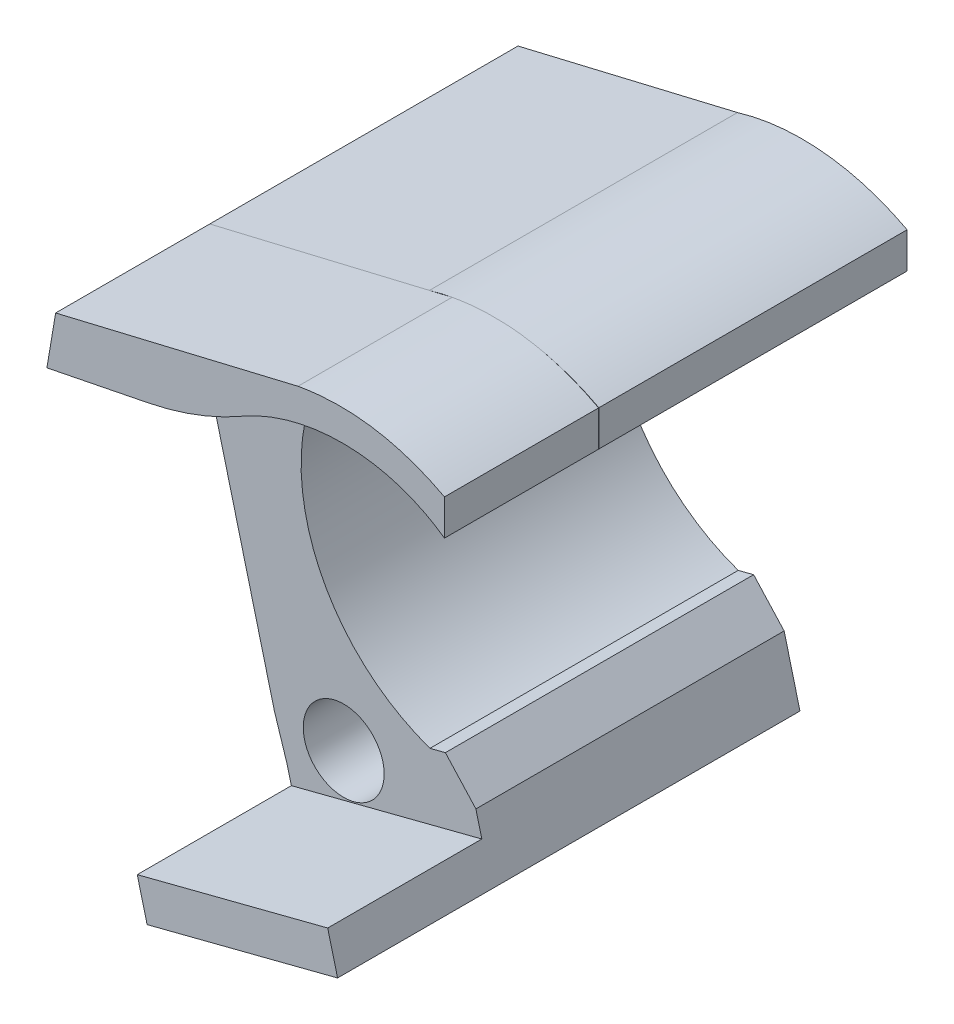
ISO-10303-21;
HEADER;
FILE_DESCRIPTION(('STEP AP214'),'2;1');
FILE_NAME('part.step','',(''),(''),'','','');
FILE_SCHEMA(('AUTOMOTIVE_DESIGN { 1 0 10303 214 1 1 1 1 }'));
ENDSEC;
DATA;
#1=APPLICATION_CONTEXT('core data for automotive mechanical design processes');
#2=APPLICATION_PROTOCOL_DEFINITION('international standard','automotive_design',2000,#1);
#3=PRODUCT_CONTEXT('',#1,'mechanical');
#4=PRODUCT('Part','Part','',(#3));
#5=PRODUCT_RELATED_PRODUCT_CATEGORY('part','',(#4));
#6=PRODUCT_DEFINITION_FORMATION('','',#4);
#7=PRODUCT_DEFINITION_CONTEXT('part definition',#1,'design');
#8=PRODUCT_DEFINITION('design','',#6,#7);
#9=PRODUCT_DEFINITION_SHAPE('','',#8);
#10=(LENGTH_UNIT() NAMED_UNIT(*) SI_UNIT(.MILLI.,.METRE.));
#11=(NAMED_UNIT(*) PLANE_ANGLE_UNIT() SI_UNIT($,.RADIAN.));
#12=(NAMED_UNIT(*) SI_UNIT($,.STERADIAN.) SOLID_ANGLE_UNIT());
#13=UNCERTAINTY_MEASURE_WITH_UNIT(LENGTH_MEASURE(1.E-05),#10,'distance_accuracy_value','');
#14=(GEOMETRIC_REPRESENTATION_CONTEXT(3) GLOBAL_UNCERTAINTY_ASSIGNED_CONTEXT((#13)) GLOBAL_UNIT_ASSIGNED_CONTEXT((#10,
#11,#12)) REPRESENTATION_CONTEXT('',''));
#15=CARTESIAN_POINT('',(0.,0.,0.));
#16=DIRECTION('',(0.,0.,1.));
#17=DIRECTION('',(1.,0.,0.));
#18=AXIS2_PLACEMENT_3D('',#15,#16,#17);
#19=CARTESIAN_POINT('',(6.21706698044238,2.36319035345385,20.));
#20=DIRECTION('',(0.,0.,1.));
#21=DIRECTION('',(1.,0.,0.));
#22=AXIS2_PLACEMENT_3D('',#19,#20,#21);
#23=PLANE('',#22);
#24=CARTESIAN_POINT('',(-8.52643317852499,7.66022940909251,20.));
#25=DIRECTION('',(0.,0.,1.));
#26=DIRECTION('',(1.,0.,0.));
#27=AXIS2_PLACEMENT_3D('',#24,#25,#26);
#28=CIRCLE('',#27,2.62500000000004);
#29=CARTESIAN_POINT('',(-5.90143317852495,7.66022940909251,20.));
#30=VERTEX_POINT('',#29);
#31=EDGE_CURVE('E301',#30,#30,#28,.T.);
#32=ORIENTED_EDGE('',*,*,#31,.F.);
#33=EDGE_LOOP('',(#32));
#34=FACE_BOUND('',#33,.T.);
#35=CARTESIAN_POINT('',(-3.52033937728079,-12.3631903534543,20.));
#36=DIRECTION('',(0.,0.,1.));
#37=DIRECTION('',(1.,0.,0.));
#38=AXIS2_PLACEMENT_3D('',#35,#36,#37);
#39=CIRCLE('',#38,2.625);
#40=CARTESIAN_POINT('',(-0.895339377280791,-12.3631903534543,20.));
#41=VERTEX_POINT('',#40);
#42=EDGE_CURVE('E288',#41,#41,#39,.T.);
#43=ORIENTED_EDGE('',*,*,#42,.F.);
#44=EDGE_LOOP('',(#43));
#45=FACE_BOUND('',#44,.T.);
#46=DIRECTION('',(0.249211228843992,-0.968449153759797,0.));
#47=VECTOR('',#46,1.);
#48=CARTESIAN_POINT('',(-6.27373327336889,-18.5142254607358,20.));
#49=LINE('',#48,#47);
#50=CARTESIAN_POINT('',(-7.18429004086763,-14.9757495460472,20.));
#51=VERTEX_POINT('',#50);
#52=CARTESIAN_POINT('',(-6.91426899658147,-16.0250668382467,20.));
#53=VERTEX_POINT('',#52);
#54=EDGE_CURVE('E498',#51,#53,#49,.T.);
#55=ORIENTED_EDGE('',*,*,#54,.T.);
#56=DIRECTION('',(-0.968449153759797,-0.249211228843992,0.));
#57=VECTOR('',#56,1.);
#58=CARTESIAN_POINT('',(-6.91426899658147,-16.0250668382467,20.));
#59=LINE('',#58,#57);
#60=CARTESIAN_POINT('',(5.44360341302429,-12.8450128755386,20.));
#61=VERTEX_POINT('',#60);
#62=EDGE_CURVE('E239',#61,#53,#59,.T.);
#63=ORIENTED_EDGE('',*,*,#62,.F.);
#64=DIRECTION('',(-0.249211228843992,0.968449153759797,0.));
#65=VECTOR('',#64,1.);
#66=CARTESIAN_POINT('',(5.05792450172748,-11.346242466994,20.));
#67=LINE('',#66,#65);
#68=CARTESIAN_POINT('',(5.05792450172748,-11.346242466994,20.));
#69=VERTEX_POINT('',#68);
#70=EDGE_CURVE('E496',#61,#69,#67,.T.);
#71=ORIENTED_EDGE('',*,*,#70,.T.);
#72=DIRECTION('',(-0.673575724194871,0.739118220432534,0.));
#73=VECTOR('',#72,1.);
#74=CARTESIAN_POINT('',(3.07887522949627,-9.17462118716204,20.));
#75=LINE('',#74,#73);
#76=CARTESIAN_POINT('',(3.07887522949627,-9.17462118716204,20.));
#77=VERTEX_POINT('',#76);
#78=EDGE_CURVE('E494',#69,#77,#75,.T.);
#79=ORIENTED_EDGE('',*,*,#78,.T.);
#80=DIRECTION('',(-0.968449153759797,-0.249211228843991,0.));
#81=VECTOR('',#80,1.);
#82=CARTESIAN_POINT('',(2.07887522949626,-9.43195140204888,20.));
#83=LINE('',#82,#81);
#84=CARTESIAN_POINT('',(2.07887522949626,-9.43195140204888,20.));
#85=VERTEX_POINT('',#84);
#86=EDGE_CURVE('E459',#77,#85,#83,.T.);
#87=ORIENTED_EDGE('',*,*,#86,.T.);
#88=CARTESIAN_POINT('',(6.21706698044238,2.36319035345385,20.));
#89=DIRECTION('',(0.,0.,-1.));
#90=DIRECTION('',(1.,0.,0.));
#91=AXIS2_PLACEMENT_3D('',#88,#89,#90);
#92=CIRCLE('',#91,12.5000000000001);
#93=CARTESIAN_POINT('',(-2.14875020251746,11.650983571506,20.));
#94=VERTEX_POINT('',#93);
#95=EDGE_CURVE('E421',#85,#94,#92,.T.);
#96=ORIENTED_EDGE('',*,*,#95,.T.);
#97=CARTESIAN_POINT('',(-2.14875020251746,11.650983571506,20.));
#98=CARTESIAN_POINT('',(-1.824492343749,11.9430531625174,20.));
#99=CARTESIAN_POINT('',(-1.48065518380505,12.2117980460191,20.));
#100=B_SPLINE_CURVE_WITH_KNOTS('',2,(#97,#98,#99),.UNSPECIFIED.,.F.,.F.,(3,3),(0.,1.),.UNSPECIFIED.);
#101=CARTESIAN_POINT('',(-1.48065518380505,12.2117980460191,20.));
#102=VERTEX_POINT('',#101);
#103=EDGE_CURVE('E365',#94,#102,#100,.T.);
#104=ORIENTED_EDGE('',*,*,#103,.T.);
#105=CARTESIAN_POINT('',(-0.365488456900622,12.9895709185526,20.));
#106=VERTEX_POINT('',#105);
#107=EDGE_CURVE('E419',#102,#106,#92,.T.);
#108=ORIENTED_EDGE('',*,*,#107,.T.);
#109=CARTESIAN_POINT('',(-10.1162684343361,30.4515951377445,20.));
#110=DIRECTION('',(0.,0.,1.));
#111=DIRECTION('',(1.,0.,0.));
#112=AXIS2_PLACEMENT_3D('',#109,#110,#111);
#113=CIRCLE('',#112,20.);
#114=CARTESIAN_POINT('',(-6.18478654664914,10.8418156854715,20.));
#115=VERTEX_POINT('',#114);
#116=EDGE_CURVE('E11',#106,#115,#113,.F.);
#117=ORIENTED_EDGE('',*,*,#116,.T.);
#118=DIRECTION('',(0.980488972613651,0.196574094384348,0.));
#119=VECTOR('',#118,1.);
#120=CARTESIAN_POINT('',(-12.7765907056596,9.52025270097164,20.));
#121=LINE('',#120,#119);
#122=CARTESIAN_POINT('',(-12.7765907056596,9.52025270097164,20.));
#123=VERTEX_POINT('',#122);
#124=EDGE_CURVE('E366',#123,#115,#121,.T.);
#125=ORIENTED_EDGE('',*,*,#124,.F.);
#126=DIRECTION('',(-0.166040492856373,-0.986118935388634,0.));
#127=VECTOR('',#126,1.);
#128=CARTESIAN_POINT('',(-12.9639683877738,8.40741162694617,20.));
#129=LINE('',#128,#127);
#130=CARTESIAN_POINT('',(-12.9639683877738,8.40741162694617,20.));
#131=VERTEX_POINT('',#130);
#132=EDGE_CURVE('E506',#123,#131,#129,.T.);
#133=ORIENTED_EDGE('',*,*,#132,.T.);
#134=CARTESIAN_POINT('',(-8.52643317852499,7.66022940909251,20.));
#135=DIRECTION('',(0.,0.,1.));
#136=DIRECTION('',(1.,0.,0.));
#137=AXIS2_PLACEMENT_3D('',#134,#135,#136);
#138=CIRCLE('',#137,4.49999999999992);
#139=CARTESIAN_POINT('',(-12.8783605692002,6.51535911674923,20.));
#140=VERTEX_POINT('',#139);
#141=EDGE_CURVE('E504',#131,#140,#138,.T.);
#142=ORIENTED_EDGE('',*,*,#141,.T.);
#143=DIRECTION('',(0.249211228843991,-0.968449153759797,0.));
#144=VECTOR('',#143,1.);
#145=CARTESIAN_POINT('',(-12.8783605692002,6.51535911674923,20.));
#146=LINE('',#145,#144);
#147=CARTESIAN_POINT('',(-8.02033937728079,-12.3631903534543,20.));
#148=VERTEX_POINT('',#147);
#149=EDGE_CURVE('E502',#140,#148,#146,.T.);
#150=ORIENTED_EDGE('',*,*,#149,.T.);
#151=DIRECTION('',(0.304785778396192,-0.952420930727285,0.));
#152=VECTOR('',#151,1.);
#153=CARTESIAN_POINT('',(-7.18429004086763,-14.9757495460472,20.));
#154=LINE('',#153,#152);
#155=EDGE_CURVE('E500',#148,#51,#154,.T.);
#156=ORIENTED_EDGE('',*,*,#155,.T.);
#157=EDGE_LOOP('',(#55,#63,#71,#79,#87,#96,#104,#108,#117,#125,#133,#142,#150,#156));
#158=FACE_BOUND('',#157,.T.);
#159=ADVANCED_FACE('F37',(#34,#45,#158),#23,.T.);
#160=CARTESIAN_POINT('',(13.0203393772824,15.1680911611288,20.));
#161=CARTESIAN_POINT('',(8.54354806774529,17.5408216803785,20.));
#162=CARTESIAN_POINT('',(3.51569604462101,16.632060198804,20.));
#163=B_SPLINE_CURVE_WITH_KNOTS('',2,(#160,#161,#162),.UNSPECIFIED.,.F.,.F.,(3,3),(0.,1.),.UNSPECIFIED.);
#164=CARTESIAN_POINT('',(13.0203393772824,15.1680911611288,20.));
#165=VERTEX_POINT('',#164);
#166=CARTESIAN_POINT('',(8.77719000469298,16.6580783102427,20.));
#167=VERTEX_POINT('',#166);
#168=EDGE_CURVE('E250',#165,#167,#163,.T.);
#169=ORIENTED_EDGE('',*,*,#168,.F.);
#170=DIRECTION('',(0.,1.,0.));
#171=VECTOR('',#170,1.);
#172=CARTESIAN_POINT('',(13.0203393772824,12.849633253427,20.));
#173=LINE('',#172,#171);
#174=CARTESIAN_POINT('',(13.0203393741779,12.8776963088814,20.));
#175=VERTEX_POINT('',#174);
#176=EDGE_CURVE('E386',#175,#165,#173,.T.);
#177=ORIENTED_EDGE('',*,*,#176,.F.);
#178=CARTESIAN_POINT('',(-0.33287714764087,13.0097030181244,20.));
#179=CARTESIAN_POINT('',(3.63531983074149,15.4300888750587,20.));
#180=CARTESIAN_POINT('',(9.06122238437333,15.6828100548504,20.));
#181=CARTESIAN_POINT('',(13.0361434432035,12.8665204564571,20.));
#182=B_SPLINE_CURVE_WITH_KNOTS('',3,(#178,#179,#180,#181),.UNSPECIFIED.,.F.,.F.,(4,4),
(0.13798914785217,1.),.UNSPECIFIED.);
#183=CARTESIAN_POINT('',(13.0361434432035,12.8665204564571,20.));
#184=VERTEX_POINT('',#183);
#185=EDGE_CURVE('E314',#175,#184,#182,.T.);
#186=ORIENTED_EDGE('',*,*,#185,.T.);
#187=DIRECTION('',(0.,1.,0.));
#188=VECTOR('',#187,1.);
#189=CARTESIAN_POINT('',(13.0361434432035,12.8665204564571,20.));
#190=LINE('',#189,#188);
#191=CARTESIAN_POINT('',(13.0361434432035,15.1849783641589,20.));
#192=VERTEX_POINT('',#191);
#193=EDGE_CURVE('E313',#184,#192,#190,.T.);
#194=ORIENTED_EDGE('',*,*,#193,.T.);
#195=CARTESIAN_POINT('',(6.21706698044238,2.36319035345385,20.));
#196=DIRECTION('',(0.,0.,1.));
#197=DIRECTION('',(1.,0.,0.));
#198=AXIS2_PLACEMENT_3D('',#195,#196,#197);
#199=CIRCLE('',#198,14.522329413577);
#200=EDGE_CURVE('E354',#192,#167,#199,.T.);
#201=ORIENTED_EDGE('',*,*,#200,.T.);
#202=EDGE_LOOP('',(#169,#177,#186,#194,#201));
#203=FACE_BOUND('',#202,.T.);
#204=ADVANCED_FACE('F544',(#203),#23,.T.);
#205=DIRECTION('',(-0.972805500576496,-0.231623526542777,0.));
#206=VECTOR('',#205,1.);
#207=CARTESIAN_POINT('',(3.51569604462101,16.632060198804,20.));
#208=LINE('',#207,#206);
#209=CARTESIAN_POINT('',(3.51569604462105,16.632060198804,20.));
#210=VERTEX_POINT('',#209);
#211=CARTESIAN_POINT('',(2.19832780114308,16.3183968014147,20.));
#212=VERTEX_POINT('',#211);
#213=EDGE_CURVE('E391',#210,#212,#208,.T.);
#214=ORIENTED_EDGE('',*,*,#213,.F.);
#215=EDGE_CURVE('E337',#210,#212,#199,.T.);
#216=ORIENTED_EDGE('',*,*,#215,.T.);
#217=EDGE_LOOP('',(#214,#216));
#218=FACE_BOUND('',#217,.T.);
#219=ADVANCED_FACE('F546',(#218),#23,.T.);
#220=CARTESIAN_POINT('',(6.21706698044238,2.36319035345385,0.));
#221=DIRECTION('',(0.,0.,1.));
#222=DIRECTION('',(1.,0.,0.));
#223=AXIS2_PLACEMENT_3D('',#220,#221,#222);
#224=PLANE('',#223);
#225=CARTESIAN_POINT('',(6.21706698044238,2.36319035345385,0.));
#226=DIRECTION('',(0.,0.,-1.));
#227=DIRECTION('',(1.,0.,0.));
#228=AXIS2_PLACEMENT_3D('',#225,#226,#227);
#229=CIRCLE('',#228,12.5000000000001);
#230=CARTESIAN_POINT('',(2.07887522949626,-9.43195140204888,0.));
#231=VERTEX_POINT('',#230);
#232=CARTESIAN_POINT('',(-0.33287714764087,13.0097030181244,0.));
#233=VERTEX_POINT('',#232);
#234=EDGE_CURVE('E304',#231,#233,#229,.T.);
#235=ORIENTED_EDGE('',*,*,#234,.F.);
#236=DIRECTION('',(-0.968449153759797,-0.249211228843991,0.));
#237=VECTOR('',#236,1.);
#238=CARTESIAN_POINT('',(2.07887522949626,-9.43195140204888,0.));
#239=LINE('',#238,#237);
#240=CARTESIAN_POINT('',(3.07887522949627,-9.17462118716204,0.));
#241=VERTEX_POINT('',#240);
#242=EDGE_CURVE('E460',#241,#231,#239,.T.);
#243=ORIENTED_EDGE('',*,*,#242,.F.);
#244=DIRECTION('',(-0.673575724194871,0.739118220432534,0.));
#245=VECTOR('',#244,1.);
#246=CARTESIAN_POINT('',(3.07887522949627,-9.17462118716204,0.));
#247=LINE('',#246,#245);
#248=CARTESIAN_POINT('',(5.05792450172748,-11.346242466994,0.));
#249=VERTEX_POINT('',#248);
#250=EDGE_CURVE('E463',#249,#241,#247,.T.);
#251=ORIENTED_EDGE('',*,*,#250,.F.);
#252=DIRECTION('',(-0.249211228843992,0.968449153759797,0.));
#253=VECTOR('',#252,1.);
#254=CARTESIAN_POINT('',(5.05792450172748,-11.346242466994,0.));
#255=LINE('',#254,#253);
#256=CARTESIAN_POINT('',(6.08413913623686,-15.3341714980277,0.));
#257=VERTEX_POINT('',#256);
#258=EDGE_CURVE('E465',#257,#249,#255,.T.);
#259=ORIENTED_EDGE('',*,*,#258,.F.);
#260=DIRECTION('',(0.968449153759797,0.249211228843991,0.));
#261=VECTOR('',#260,1.);
#262=CARTESIAN_POINT('',(6.08413913623686,-15.3341714980277,0.));
#263=LINE('',#262,#261);
#264=CARTESIAN_POINT('',(-6.27373327336889,-18.5142254607358,0.));
#265=VERTEX_POINT('',#264);
#266=EDGE_CURVE('E220',#265,#257,#263,.T.);
#267=ORIENTED_EDGE('',*,*,#266,.F.);
#268=DIRECTION('',(0.249211228843992,-0.968449153759797,0.));
#269=VECTOR('',#268,1.);
#270=CARTESIAN_POINT('',(-6.27373327336889,-18.5142254607358,0.));
#271=LINE('',#270,#269);
#272=CARTESIAN_POINT('',(-7.18429004086763,-14.9757495460472,0.));
#273=VERTEX_POINT('',#272);
#274=EDGE_CURVE('E468',#273,#265,#271,.T.);
#275=ORIENTED_EDGE('',*,*,#274,.F.);
#276=DIRECTION('',(0.304785778396192,-0.952420930727285,0.));
#277=VECTOR('',#276,1.);
#278=CARTESIAN_POINT('',(-7.18429004086763,-14.9757495460472,0.));
#279=LINE('',#278,#277);
#280=CARTESIAN_POINT('',(-8.02033937728079,-12.3631903534543,0.));
#281=VERTEX_POINT('',#280);
#282=EDGE_CURVE('E470',#281,#273,#279,.T.);
#283=ORIENTED_EDGE('',*,*,#282,.F.);
#284=DIRECTION('',(0.249211228843991,-0.968449153759797,0.));
#285=VECTOR('',#284,1.);
#286=CARTESIAN_POINT('',(-12.8783605692002,6.51535911674923,0.));
#287=LINE('',#286,#285);
#288=CARTESIAN_POINT('',(-12.8783605692002,6.51535911674923,0.));
#289=VERTEX_POINT('',#288);
#290=EDGE_CURVE('E472',#289,#281,#287,.T.);
#291=ORIENTED_EDGE('',*,*,#290,.F.);
#292=CARTESIAN_POINT('',(-8.52643317852499,7.66022940909251,0.));
#293=DIRECTION('',(0.,0.,1.));
#294=DIRECTION('',(1.,0.,0.));
#295=AXIS2_PLACEMENT_3D('',#292,#293,#294);
#296=CIRCLE('',#295,4.49999999999992);
#297=CARTESIAN_POINT('',(-12.9639683877738,8.40741162694617,0.));
#298=VERTEX_POINT('',#297);
#299=EDGE_CURVE('E474',#298,#289,#296,.T.);
#300=ORIENTED_EDGE('',*,*,#299,.F.);
#301=DIRECTION('',(-0.166040492856373,-0.986118935388634,0.));
#302=VECTOR('',#301,1.);
#303=CARTESIAN_POINT('',(-12.9639683877738,8.40741162694617,0.));
#304=LINE('',#303,#302);
#305=CARTESIAN_POINT('',(-12.2095534864732,12.8879019369534,0.));
#306=VERTEX_POINT('',#305);
#307=EDGE_CURVE('E476',#306,#298,#304,.T.);
#308=ORIENTED_EDGE('',*,*,#307,.F.);
#309=DIRECTION('',(-0.972950913660848,-0.231011946891326,0.));
#310=VECTOR('',#309,1.);
#311=CARTESIAN_POINT('',(-12.2095534864732,12.8879019369534,0.));
#312=LINE('',#311,#310);
#313=CARTESIAN_POINT('',(2.03064838580171,16.2690147068279,0.));
#314=VERTEX_POINT('',#313);
#315=EDGE_CURVE('E478',#314,#306,#312,.T.);
#316=ORIENTED_EDGE('',*,*,#315,.F.);
#317=CARTESIAN_POINT('',(6.21706698044238,2.36319035345385,0.));
#318=DIRECTION('',(0.,0.,1.));
#319=DIRECTION('',(1.,0.,0.));
#320=AXIS2_PLACEMENT_3D('',#317,#318,#319);
#321=CIRCLE('',#320,14.522329413577);
#322=CARTESIAN_POINT('',(13.0361434432035,15.1849783641589,0.));
#323=VERTEX_POINT('',#322);
#324=EDGE_CURVE('E480',#323,#314,#321,.T.);
#325=ORIENTED_EDGE('',*,*,#324,.F.);
#326=DIRECTION('',(0.,1.,0.));
#327=VECTOR('',#326,1.);
#328=CARTESIAN_POINT('',(13.0361434432035,12.8665204564571,0.));
#329=LINE('',#328,#327);
#330=CARTESIAN_POINT('',(13.0361434432035,12.8665204564571,0.));
#331=VERTEX_POINT('',#330);
#332=EDGE_CURVE('E482',#331,#323,#329,.T.);
#333=ORIENTED_EDGE('',*,*,#332,.F.);
#334=CARTESIAN_POINT('',(-0.33287714764087,13.0097030181244,0.));
#335=CARTESIAN_POINT('',(3.63531983074149,15.4300888750587,0.));
#336=CARTESIAN_POINT('',(9.06122238437333,15.6828100548504,0.));
#337=CARTESIAN_POINT('',(13.0361434432035,12.8665204564571,0.));
#338=B_SPLINE_CURVE_WITH_KNOTS('',3,(#334,#335,#336,#337),.UNSPECIFIED.,.F.,.F.,(4,4),
(0.13798914785217,1.),.UNSPECIFIED.);
#339=EDGE_CURVE('E484',#233,#331,#338,.T.);
#340=ORIENTED_EDGE('',*,*,#339,.F.);
#341=EDGE_LOOP('',(#235,#243,#251,#259,#267,#275,#283,#291,#300,#308,#316,#325,#333,#340));
#342=FACE_BOUND('',#341,.T.);
#343=CARTESIAN_POINT('',(-8.52643317852499,7.66022940909251,0.));
#344=DIRECTION('',(0.,0.,1.));
#345=DIRECTION('',(1.,0.,0.));
#346=AXIS2_PLACEMENT_3D('',#343,#344,#345);
#347=CIRCLE('',#346,2.62500000000004);
#348=CARTESIAN_POINT('',(-5.90143317852495,7.66022940909251,0.));
#349=VERTEX_POINT('',#348);
#350=EDGE_CURVE('E296',#349,#349,#347,.T.);
#351=ORIENTED_EDGE('',*,*,#350,.T.);
#352=EDGE_LOOP('',(#351));
#353=FACE_BOUND('',#352,.T.);
#354=CARTESIAN_POINT('',(-3.52033937728079,-12.3631903534543,0.));
#355=DIRECTION('',(0.,0.,1.));
#356=DIRECTION('',(1.,0.,0.));
#357=AXIS2_PLACEMENT_3D('',#354,#355,#356);
#358=CIRCLE('',#357,2.625);
#359=CARTESIAN_POINT('',(-0.895339377280791,-12.3631903534543,0.));
#360=VERTEX_POINT('',#359);
#361=EDGE_CURVE('E297',#360,#360,#358,.T.);
#362=ORIENTED_EDGE('',*,*,#361,.T.);
#363=EDGE_LOOP('',(#362));
#364=FACE_BOUND('',#363,.T.);
#365=ADVANCED_FACE('F329',(#342,#353,#364),#224,.F.);
#366=CARTESIAN_POINT('',(6.21706698044238,2.36319035345385,20.));
#367=DIRECTION('',(0.,0.,-1.));
#368=DIRECTION('',(-1.,0.,0.));
#369=AXIS2_PLACEMENT_3D('',#366,#367,#368);
#370=CYLINDRICAL_SURFACE('',#369,12.5000000000001);
#371=ORIENTED_EDGE('',*,*,#234,.T.);
#372=DIRECTION('',(0.,0.,-1.));
#373=VECTOR('',#372,1.);
#374=CARTESIAN_POINT('',(-0.33287714764087,13.0097030181244,20.));
#375=LINE('',#374,#373);
#376=CARTESIAN_POINT('',(-0.33287714764087,13.0097030181244,20.));
#377=VERTEX_POINT('',#376);
#378=EDGE_CURVE('E387',#377,#233,#375,.T.);
#379=ORIENTED_EDGE('',*,*,#378,.F.);
#380=EDGE_CURVE('E462',#106,#377,#92,.T.);
#381=ORIENTED_EDGE('',*,*,#380,.F.);
#382=ORIENTED_EDGE('',*,*,#107,.F.);
#383=ORIENTED_EDGE('',*,*,#103,.F.);
#384=ORIENTED_EDGE('',*,*,#95,.F.);
#385=DIRECTION('',(0.,0.,-1.));
#386=VECTOR('',#385,1.);
#387=CARTESIAN_POINT('',(2.07887522949626,-9.43195140204888,20.));
#388=LINE('',#387,#386);
#389=EDGE_CURVE('E456',#85,#231,#388,.T.);
#390=ORIENTED_EDGE('',*,*,#389,.T.);
#391=EDGE_LOOP('',(#371,#379,#381,#382,#383,#384,#390));
#392=FACE_BOUND('',#391,.T.);
#393=ADVANCED_FACE('F324',(#392),#370,.F.);
#394=DIRECTION('',(0.,0.,-1.));
#395=VECTOR('',#394,1.);
#396=SURFACE_OF_LINEAR_EXTRUSION('',#182,#395);
#397=ORIENTED_EDGE('',*,*,#339,.T.);
#398=DIRECTION('',(0.,0.,-1.));
#399=VECTOR('',#398,1.);
#400=CARTESIAN_POINT('',(13.0361434432035,12.8665204564571,20.));
#401=LINE('',#400,#399);
#402=EDGE_CURVE('E426',#184,#331,#401,.T.);
#403=ORIENTED_EDGE('',*,*,#402,.F.);
#404=ORIENTED_EDGE('',*,*,#185,.F.);
#405=EDGE_CURVE('E307',#377,#175,#182,.T.);
#406=ORIENTED_EDGE('',*,*,#405,.F.);
#407=ORIENTED_EDGE('',*,*,#378,.T.);
#408=EDGE_LOOP('',(#397,#403,#404,#406,#407));
#409=FACE_BOUND('',#408,.T.);
#410=ADVANCED_FACE('F320',(#409),#396,.F.);
#411=CARTESIAN_POINT('',(13.0361434432035,12.8665204564571,20.));
#412=DIRECTION('',(-1.,0.,0.));
#413=DIRECTION('',(0.,0.,1.));
#414=AXIS2_PLACEMENT_3D('',#411,#412,#413);
#415=PLANE('',#414);
#416=ORIENTED_EDGE('',*,*,#332,.T.);
#417=DIRECTION('',(0.,0.,-1.));
#418=VECTOR('',#417,1.);
#419=CARTESIAN_POINT('',(13.0361434432035,15.1849783641589,20.));
#420=LINE('',#419,#418);
#421=EDGE_CURVE('E429',#192,#323,#420,.T.);
#422=ORIENTED_EDGE('',*,*,#421,.F.);
#423=ORIENTED_EDGE('',*,*,#193,.F.);
#424=ORIENTED_EDGE('',*,*,#402,.T.);
#425=EDGE_LOOP('',(#416,#422,#423,#424));
#426=FACE_BOUND('',#425,.T.);
#427=ADVANCED_FACE('F323',(#426),#415,.F.);
#428=CARTESIAN_POINT('',(6.21706698044238,2.36319035345385,20.));
#429=DIRECTION('',(0.,0.,-1.));
#430=DIRECTION('',(-1.,0.,0.));
#431=AXIS2_PLACEMENT_3D('',#428,#429,#430);
#432=CYLINDRICAL_SURFACE('',#431,14.522329413577);
#433=ORIENTED_EDGE('',*,*,#324,.T.);
#434=DIRECTION('',(0.,0.,-1.));
#435=VECTOR('',#434,1.);
#436=CARTESIAN_POINT('',(2.03064838580171,16.2690147068279,20.));
#437=LINE('',#436,#435);
#438=CARTESIAN_POINT('',(2.03064838580171,16.2690147068279,20.));
#439=VERTEX_POINT('',#438);
#440=EDGE_CURVE('E432',#439,#314,#437,.T.);
#441=ORIENTED_EDGE('',*,*,#440,.F.);
#442=EDGE_CURVE('E345',#212,#439,#199,.T.);
#443=ORIENTED_EDGE('',*,*,#442,.F.);
#444=ORIENTED_EDGE('',*,*,#215,.F.);
#445=CARTESIAN_POINT('',(6.92122174652692,16.8684382886614,20.));
#446=CARTESIAN_POINT('',(5.2512911978348,16.945761162077,20.));
#447=CARTESIAN_POINT('',(3.51569604462101,16.632060198804,20.));
#448=B_SPLINE_CURVE_WITH_KNOTS('',2,(#445,#446,#447),.UNSPECIFIED.,.F.,.F.,(3,3),
(0.654803851578889,1.),.UNSPECIFIED.);
#449=CARTESIAN_POINT('',(6.92122174652701,16.8684382886614,20.));
#450=VERTEX_POINT('',#449);
#451=EDGE_CURVE('E380',#450,#210,#448,.T.);
#452=ORIENTED_EDGE('',*,*,#451,.F.);
#453=CARTESIAN_POINT('',(8.77719000470674,16.6580783102402,20.));
#454=CARTESIAN_POINT('',(7.8595724406739,16.8249897919561,20.));
#455=CARTESIAN_POINT('',(6.92122174652692,16.8684382886614,20.));
#456=B_SPLINE_CURVE_WITH_KNOTS('',2,(#453,#454,#455),.UNSPECIFIED.,.F.,.F.,(3,3),
(0.460834679782192,0.654803851578889),.UNSPECIFIED.);
#457=EDGE_CURVE('E344',#167,#450,#456,.T.);
#458=ORIENTED_EDGE('',*,*,#457,.F.);
#459=ORIENTED_EDGE('',*,*,#200,.F.);
#460=ORIENTED_EDGE('',*,*,#421,.T.);
#461=EDGE_LOOP('',(#433,#441,#443,#444,#452,#458,#459,#460));
#462=FACE_BOUND('',#461,.T.);
#463=ADVANCED_FACE('F561',(#462),#432,.T.);
#464=CARTESIAN_POINT('',(-12.2095534864732,12.8879019369534,20.));
#465=DIRECTION('',(0.231011946891326,-0.972950913660848,0.));
#466=DIRECTION('',(0.972950913660848,0.231011946891326,0.));
#467=AXIS2_PLACEMENT_3D('',#464,#465,#466);
#468=PLANE('',#467);
#469=ORIENTED_EDGE('',*,*,#315,.T.);
#470=DIRECTION('',(0.,0.,-1.));
#471=VECTOR('',#470,1.);
#472=CARTESIAN_POINT('',(-12.2095534864732,12.8879019369534,20.));
#473=LINE('',#472,#471);
#474=CARTESIAN_POINT('',(-12.2095534864732,12.8879019369534,20.));
#475=VERTEX_POINT('',#474);
#476=EDGE_CURVE('E435',#475,#306,#473,.T.);
#477=ORIENTED_EDGE('',*,*,#476,.F.);
#478=DIRECTION('',(-0.972950913660848,-0.231011946891326,0.));
#479=VECTOR('',#478,1.);
#480=CARTESIAN_POINT('',(-12.2095534864732,12.8879019369534,20.));
#481=LINE('',#480,#479);
#482=EDGE_CURVE('E358',#439,#475,#481,.T.);
#483=ORIENTED_EDGE('',*,*,#482,.F.);
#484=ORIENTED_EDGE('',*,*,#440,.T.);
#485=EDGE_LOOP('',(#469,#477,#483,#484));
#486=FACE_BOUND('',#485,.T.);
#487=ADVANCED_FACE('F564',(#486),#468,.F.);
#488=CARTESIAN_POINT('',(-12.9639683877738,8.40741162694617,20.));
#489=DIRECTION('',(0.986118935388634,-0.166040492856373,0.));
#490=DIRECTION('',(0.166040492856373,0.986118935388634,0.));
#491=AXIS2_PLACEMENT_3D('',#488,#489,#490);
#492=PLANE('',#491);
#493=ORIENTED_EDGE('',*,*,#307,.T.);
#494=DIRECTION('',(0.,0.,-1.));
#495=VECTOR('',#494,1.);
#496=CARTESIAN_POINT('',(-12.9639683877738,8.40741162694617,20.));
#497=LINE('',#496,#495);
#498=EDGE_CURVE('E438',#131,#298,#497,.T.);
#499=ORIENTED_EDGE('',*,*,#498,.F.);
#500=ORIENTED_EDGE('',*,*,#132,.F.);
#501=DIRECTION('',(0.,0.,-1.));
#502=VECTOR('',#501,1.);
#503=CARTESIAN_POINT('',(-12.7765907056596,9.52025270097164,30.));
#504=LINE('',#503,#502);
#505=CARTESIAN_POINT('',(-12.7765907056596,9.52025270097164,30.));
#506=VERTEX_POINT('',#505);
#507=EDGE_CURVE('E396',#506,#123,#504,.T.);
#508=ORIENTED_EDGE('',*,*,#507,.F.);
#509=DIRECTION('',(-0.166040492856373,-0.986118935388634,0.));
#510=VECTOR('',#509,1.);
#511=CARTESIAN_POINT('',(-12.2095534864732,12.8879019369534,30.));
#512=LINE('',#511,#510);
#513=CARTESIAN_POINT('',(-12.2095534864732,12.8879019369534,30.));
#514=VERTEX_POINT('',#513);
#515=EDGE_CURVE('E519',#514,#506,#512,.T.);
#516=ORIENTED_EDGE('',*,*,#515,.F.);
#517=DIRECTION('',(0.,0.,-1.));
#518=VECTOR('',#517,1.);
#519=CARTESIAN_POINT('',(-12.2095534864732,12.8879019369534,30.));
#520=LINE('',#519,#518);
#521=EDGE_CURVE('E393',#514,#475,#520,.T.);
#522=ORIENTED_EDGE('',*,*,#521,.T.);
#523=ORIENTED_EDGE('',*,*,#476,.T.);
#524=EDGE_LOOP('',(#493,#499,#500,#508,#516,#522,#523));
#525=FACE_BOUND('',#524,.T.);
#526=ADVANCED_FACE('F516',(#525),#492,.F.);
#527=CARTESIAN_POINT('',(-8.52643317852499,7.66022940909251,20.));
#528=DIRECTION('',(0.,0.,-1.));
#529=DIRECTION('',(-1.,0.,0.));
#530=AXIS2_PLACEMENT_3D('',#527,#528,#529);
#531=CYLINDRICAL_SURFACE('',#530,4.49999999999992);
#532=ORIENTED_EDGE('',*,*,#299,.T.);
#533=DIRECTION('',(0.,0.,-1.));
#534=VECTOR('',#533,1.);
#535=CARTESIAN_POINT('',(-12.8783605692002,6.51535911674923,20.));
#536=LINE('',#535,#534);
#537=EDGE_CURVE('E441',#140,#289,#536,.T.);
#538=ORIENTED_EDGE('',*,*,#537,.F.);
#539=ORIENTED_EDGE('',*,*,#141,.F.);
#540=ORIENTED_EDGE('',*,*,#498,.T.);
#541=EDGE_LOOP('',(#532,#538,#539,#540));
#542=FACE_BOUND('',#541,.T.);
#543=ADVANCED_FACE('F573',(#542),#531,.T.);
#544=CARTESIAN_POINT('',(-12.8783605692002,6.51535911674923,20.));
#545=DIRECTION('',(0.968449153759797,0.249211228843991,0.));
#546=DIRECTION('',(-0.249211228843991,0.968449153759797,0.));
#547=AXIS2_PLACEMENT_3D('',#544,#545,#546);
#548=PLANE('',#547);
#549=ORIENTED_EDGE('',*,*,#290,.T.);
#550=DIRECTION('',(0.,0.,-1.));
#551=VECTOR('',#550,1.);
#552=CARTESIAN_POINT('',(-8.02033937728079,-12.3631903534543,20.));
#553=LINE('',#552,#551);
#554=EDGE_CURVE('E444',#148,#281,#553,.T.);
#555=ORIENTED_EDGE('',*,*,#554,.F.);
#556=ORIENTED_EDGE('',*,*,#149,.F.);
#557=ORIENTED_EDGE('',*,*,#537,.T.);
#558=EDGE_LOOP('',(#549,#555,#556,#557));
#559=FACE_BOUND('',#558,.T.);
#560=ADVANCED_FACE('F633',(#559),#548,.F.);
#561=CARTESIAN_POINT('',(-7.18429004086763,-14.9757495460472,20.));
#562=DIRECTION('',(0.952420930727285,0.304785778396192,0.));
#563=DIRECTION('',(-0.304785778396192,0.952420930727285,0.));
#564=AXIS2_PLACEMENT_3D('',#561,#562,#563);
#565=PLANE('',#564);
#566=ORIENTED_EDGE('',*,*,#282,.T.);
#567=DIRECTION('',(0.,0.,-1.));
#568=VECTOR('',#567,1.);
#569=CARTESIAN_POINT('',(-7.18429004086763,-14.9757495460472,20.));
#570=LINE('',#569,#568);
#571=EDGE_CURVE('E447',#51,#273,#570,.T.);
#572=ORIENTED_EDGE('',*,*,#571,.F.);
#573=ORIENTED_EDGE('',*,*,#155,.F.);
#574=ORIENTED_EDGE('',*,*,#554,.T.);
#575=EDGE_LOOP('',(#566,#572,#573,#574));
#576=FACE_BOUND('',#575,.T.);
#577=ADVANCED_FACE('F636',(#576),#565,.F.);
#578=CARTESIAN_POINT('',(-6.27373327336889,-18.5142254607358,20.));
#579=DIRECTION('',(0.968449153759797,0.249211228843992,0.));
#580=DIRECTION('',(-0.249211228843992,0.968449153759797,0.));
#581=AXIS2_PLACEMENT_3D('',#578,#579,#580);
#582=PLANE('',#581);
#583=ORIENTED_EDGE('',*,*,#274,.T.);
#584=DIRECTION('',(0.,0.,-1.));
#585=VECTOR('',#584,1.);
#586=CARTESIAN_POINT('',(-6.27373327336889,-18.5142254607358,20.));
#587=LINE('',#586,#585);
#588=CARTESIAN_POINT('',(-6.27373327336889,-18.5142254607358,30.));
#589=VERTEX_POINT('',#588);
#590=EDGE_CURVE('E223',#589,#265,#587,.T.);
#591=ORIENTED_EDGE('',*,*,#590,.F.);
#592=DIRECTION('',(0.249211228843992,-0.968449153759797,0.));
#593=VECTOR('',#592,1.);
#594=CARTESIAN_POINT('',(-6.27373327336889,-18.5142254607358,30.));
#595=LINE('',#594,#593);
#596=CARTESIAN_POINT('',(-6.91426899658147,-16.0250668382467,30.));
#597=VERTEX_POINT('',#596);
#598=EDGE_CURVE('E238',#597,#589,#595,.T.);
#599=ORIENTED_EDGE('',*,*,#598,.F.);
#600=DIRECTION('',(0.,0.,-1.));
#601=VECTOR('',#600,1.);
#602=CARTESIAN_POINT('',(-6.91426899658147,-16.0250668382467,30.));
#603=LINE('',#602,#601);
#604=EDGE_CURVE('E245',#597,#53,#603,.T.);
#605=ORIENTED_EDGE('',*,*,#604,.T.);
#606=ORIENTED_EDGE('',*,*,#54,.F.);
#607=ORIENTED_EDGE('',*,*,#571,.T.);
#608=EDGE_LOOP('',(#583,#591,#599,#605,#606,#607));
#609=FACE_BOUND('',#608,.T.);
#610=ADVANCED_FACE('F640',(#609),#582,.F.);
#611=CARTESIAN_POINT('',(6.08413913623686,-15.3341714980277,20.));
#612=DIRECTION('',(-0.249211228843991,0.968449153759797,0.));
#613=DIRECTION('',(-0.968449153759797,-0.249211228843991,0.));
#614=AXIS2_PLACEMENT_3D('',#611,#612,#613);
#615=PLANE('',#614);
#616=ORIENTED_EDGE('',*,*,#266,.T.);
#617=DIRECTION('',(0.,0.,-1.));
#618=VECTOR('',#617,1.);
#619=CARTESIAN_POINT('',(6.08413913623686,-15.3341714980277,20.));
#620=LINE('',#619,#618);
#621=CARTESIAN_POINT('',(6.08413913623686,-15.3341714980277,30.));
#622=VERTEX_POINT('',#621);
#623=EDGE_CURVE('E213',#622,#257,#620,.T.);
#624=ORIENTED_EDGE('',*,*,#623,.F.);
#625=DIRECTION('',(0.968449153759797,0.249211228843991,0.));
#626=VECTOR('',#625,1.);
#627=CARTESIAN_POINT('',(6.08413913623686,-15.3341714980277,30.));
#628=LINE('',#627,#626);
#629=EDGE_CURVE('E218',#589,#622,#628,.T.);
#630=ORIENTED_EDGE('',*,*,#629,.F.);
#631=ORIENTED_EDGE('',*,*,#590,.T.);
#632=EDGE_LOOP('',(#616,#624,#630,#631));
#633=FACE_BOUND('',#632,.T.);
#634=ADVANCED_FACE('F215',(#633),#615,.F.);
#635=CARTESIAN_POINT('',(5.05792450172748,-11.346242466994,20.));
#636=DIRECTION('',(-0.968449153759797,-0.249211228843992,0.));
#637=DIRECTION('',(0.249211228843992,-0.968449153759797,0.));
#638=AXIS2_PLACEMENT_3D('',#635,#636,#637);
#639=PLANE('',#638);
#640=ORIENTED_EDGE('',*,*,#258,.T.);
#641=DIRECTION('',(0.,0.,-1.));
#642=VECTOR('',#641,1.);
#643=CARTESIAN_POINT('',(5.05792450172748,-11.346242466994,20.));
#644=LINE('',#643,#642);
#645=EDGE_CURVE('E224',#69,#249,#644,.T.);
#646=ORIENTED_EDGE('',*,*,#645,.F.);
#647=ORIENTED_EDGE('',*,*,#70,.F.);
#648=DIRECTION('',(0.,0.,-1.));
#649=VECTOR('',#648,1.);
#650=CARTESIAN_POINT('',(5.44360341302429,-12.8450128755386,30.));
#651=LINE('',#650,#649);
#652=CARTESIAN_POINT('',(5.44360341302429,-12.8450128755386,30.));
#653=VERTEX_POINT('',#652);
#654=EDGE_CURVE('E230',#653,#61,#651,.T.);
#655=ORIENTED_EDGE('',*,*,#654,.F.);
#656=DIRECTION('',(-0.249211228843992,0.968449153759797,0.));
#657=VECTOR('',#656,1.);
#658=CARTESIAN_POINT('',(5.44360341302429,-12.8450128755386,30.));
#659=LINE('',#658,#657);
#660=EDGE_CURVE('E227',#622,#653,#659,.T.);
#661=ORIENTED_EDGE('',*,*,#660,.F.);
#662=ORIENTED_EDGE('',*,*,#623,.T.);
#663=EDGE_LOOP('',(#640,#646,#647,#655,#661,#662));
#664=FACE_BOUND('',#663,.T.);
#665=ADVANCED_FACE('F228',(#664),#639,.F.);
#666=CARTESIAN_POINT('',(3.07887522949627,-9.17462118716204,20.));
#667=DIRECTION('',(-0.739118220432534,-0.673575724194871,0.));
#668=DIRECTION('',(0.673575724194871,-0.739118220432534,0.));
#669=AXIS2_PLACEMENT_3D('',#666,#667,#668);
#670=PLANE('',#669);
#671=ORIENTED_EDGE('',*,*,#250,.T.);
#672=DIRECTION('',(0.,0.,-1.));
#673=VECTOR('',#672,1.);
#674=CARTESIAN_POINT('',(3.07887522949627,-9.17462118716204,20.));
#675=LINE('',#674,#673);
#676=EDGE_CURVE('E453',#77,#241,#675,.T.);
#677=ORIENTED_EDGE('',*,*,#676,.F.);
#678=ORIENTED_EDGE('',*,*,#78,.F.);
#679=ORIENTED_EDGE('',*,*,#645,.T.);
#680=EDGE_LOOP('',(#671,#677,#678,#679));
#681=FACE_BOUND('',#680,.T.);
#682=ADVANCED_FACE('F649',(#681),#670,.F.);
#683=CARTESIAN_POINT('',(2.07887522949626,-9.43195140204888,20.));
#684=DIRECTION('',(0.249211228843991,-0.968449153759797,0.));
#685=DIRECTION('',(0.968449153759797,0.249211228843991,0.));
#686=AXIS2_PLACEMENT_3D('',#683,#684,#685);
#687=PLANE('',#686);
#688=ORIENTED_EDGE('',*,*,#242,.T.);
#689=ORIENTED_EDGE('',*,*,#389,.F.);
#690=ORIENTED_EDGE('',*,*,#86,.F.);
#691=ORIENTED_EDGE('',*,*,#676,.T.);
#692=EDGE_LOOP('',(#688,#689,#690,#691));
#693=FACE_BOUND('',#692,.T.);
#694=ADVANCED_FACE('F652',(#693),#687,.F.);
#695=CARTESIAN_POINT('',(-8.52643317852499,7.66022940909251,20.));
#696=DIRECTION('',(0.,0.,-1.));
#697=DIRECTION('',(-1.,0.,0.));
#698=AXIS2_PLACEMENT_3D('',#695,#696,#697);
#699=CYLINDRICAL_SURFACE('',#698,2.62500000000004);
#700=ORIENTED_EDGE('',*,*,#31,.T.);
#701=EDGE_LOOP('',(#700));
#702=FACE_BOUND('',#701,.T.);
#703=ORIENTED_EDGE('',*,*,#350,.F.);
#704=EDGE_LOOP('',(#703));
#705=FACE_BOUND('',#704,.T.);
#706=ADVANCED_FACE('F655',(#702,#705),#699,.F.);
#707=CARTESIAN_POINT('',(-3.52033937728079,-12.3631903534543,20.));
#708=DIRECTION('',(0.,0.,-1.));
#709=DIRECTION('',(-1.,0.,0.));
#710=AXIS2_PLACEMENT_3D('',#707,#708,#709);
#711=CYLINDRICAL_SURFACE('',#710,2.625);
#712=ORIENTED_EDGE('',*,*,#42,.T.);
#713=EDGE_LOOP('',(#712));
#714=FACE_BOUND('',#713,.T.);
#715=ORIENTED_EDGE('',*,*,#361,.F.);
#716=EDGE_LOOP('',(#715));
#717=FACE_BOUND('',#716,.T.);
#718=ADVANCED_FACE('F273',(#714,#717),#711,.F.);
#719=CARTESIAN_POINT('',(8.4057828893485,16.7204486801725,20.));
#720=DIRECTION('',(0.,0.,-1.));
#721=DIRECTION('',(-1.,0.,0.));
#722=AXIS2_PLACEMENT_3D('',#719,#720,#721);
#723=PLANE('',#722);
#724=CARTESIAN_POINT('',(-2.14875020251746,11.650983571506,20.));
#725=CARTESIAN_POINT('',(1.82546253510665,15.2508206749215,20.));
#726=CARTESIAN_POINT('',(8.40154324036673,16.1219463022782,20.));
#727=CARTESIAN_POINT('',(13.0203393772824,12.849633253427,20.));
#728=B_SPLINE_CURVE_WITH_KNOTS('',3,(#724,#725,#726,#727),.UNSPECIFIED.,.F.,.F.,(4,4),(0.,1.),.UNSPECIFIED.);
#729=CARTESIAN_POINT('',(-0.100282379080844,13.1403264568842,20.));
#730=VERTEX_POINT('',#729);
#731=CARTESIAN_POINT('',(13.0203393772824,12.849633253427,20.));
#732=VERTEX_POINT('',#731);
#733=EDGE_CURVE('E362',#730,#732,#728,.T.);
#734=ORIENTED_EDGE('',*,*,#733,.F.);
#735=CARTESIAN_POINT('',(-10.1162684343361,30.4515951377445,20.));
#736=DIRECTION('',(0.,0.,-1.));
#737=DIRECTION('',(-1.,0.,0.));
#738=AXIS2_PLACEMENT_3D('',#735,#736,#737);
#739=CIRCLE('',#738,20.);
#740=EDGE_CURVE('E584',#730,#106,#739,.T.);
#741=ORIENTED_EDGE('',*,*,#740,.T.);
#742=ORIENTED_EDGE('',*,*,#380,.T.);
#743=ORIENTED_EDGE('',*,*,#405,.T.);
#744=EDGE_CURVE('E258',#732,#175,#173,.T.);
#745=ORIENTED_EDGE('',*,*,#744,.F.);
#746=EDGE_LOOP('',(#734,#741,#742,#743,#745));
#747=FACE_BOUND('',#746,.T.);
#748=ADVANCED_FACE('F270',(#747),#723,.T.);
#749=CARTESIAN_POINT('',(13.0203393772824,15.1680911611288,30.));
#750=CARTESIAN_POINT('',(8.54354806774529,17.5408216803785,30.));
#751=CARTESIAN_POINT('',(3.51569604462101,16.632060198804,30.));
#752=B_SPLINE_CURVE_WITH_KNOTS('',2,(#749,#750,#751),.UNSPECIFIED.,.F.,.F.,(3,3),(0.,1.),.UNSPECIFIED.);
#753=DIRECTION('',(0.,0.,-1.));
#754=VECTOR('',#753,1.);
#755=SURFACE_OF_LINEAR_EXTRUSION('',#752,#754);
#756=ORIENTED_EDGE('',*,*,#168,.T.);
#757=ORIENTED_EDGE('',*,*,#457,.T.);
#758=ORIENTED_EDGE('',*,*,#451,.T.);
#759=DIRECTION('',(0.,0.,-1.));
#760=VECTOR('',#759,1.);
#761=CARTESIAN_POINT('',(3.51569604462101,16.632060198804,30.));
#762=LINE('',#761,#760);
#763=CARTESIAN_POINT('',(3.51569604462101,16.632060198804,30.));
#764=VERTEX_POINT('',#763);
#765=EDGE_CURVE('E300',#764,#210,#762,.T.);
#766=ORIENTED_EDGE('',*,*,#765,.F.);
#767=CARTESIAN_POINT('',(13.0203393772824,15.1680911611288,30.));
#768=VERTEX_POINT('',#767);
#769=EDGE_CURVE('E251',#768,#764,#752,.T.);
#770=ORIENTED_EDGE('',*,*,#769,.F.);
#771=DIRECTION('',(0.,0.,-1.));
#772=VECTOR('',#771,1.);
#773=CARTESIAN_POINT('',(13.0203393772824,15.1680911611288,30.));
#774=LINE('',#773,#772);
#775=EDGE_CURVE('E409',#768,#165,#774,.T.);
#776=ORIENTED_EDGE('',*,*,#775,.T.);
#777=EDGE_LOOP('',(#756,#757,#758,#766,#770,#776));
#778=FACE_BOUND('',#777,.T.);
#779=ADVANCED_FACE('F264',(#778),#755,.F.);
#780=CARTESIAN_POINT('',(3.51569604462101,16.632060198804,30.));
#781=DIRECTION('',(0.231623526542777,-0.972805500576496,0.));
#782=DIRECTION('',(0.972805500576496,0.231623526542777,0.));
#783=AXIS2_PLACEMENT_3D('',#780,#781,#782);
#784=PLANE('',#783);
#785=ORIENTED_EDGE('',*,*,#213,.T.);
#786=EDGE_CURVE('E400',#212,#475,#208,.T.);
#787=ORIENTED_EDGE('',*,*,#786,.T.);
#788=ORIENTED_EDGE('',*,*,#521,.F.);
#789=DIRECTION('',(-0.972805500576496,-0.231623526542777,0.));
#790=VECTOR('',#789,1.);
#791=CARTESIAN_POINT('',(3.51569604462101,16.632060198804,30.));
#792=LINE('',#791,#790);
#793=EDGE_CURVE('E257',#764,#514,#792,.T.);
#794=ORIENTED_EDGE('',*,*,#793,.F.);
#795=ORIENTED_EDGE('',*,*,#765,.T.);
#796=EDGE_LOOP('',(#785,#787,#788,#794,#795));
#797=FACE_BOUND('',#796,.T.);
#798=ADVANCED_FACE('F269',(#797),#784,.F.);
#799=CARTESIAN_POINT('',(-12.7765907056596,9.52025270097164,30.));
#800=DIRECTION('',(-0.196574094384348,0.980488972613651,0.));
#801=DIRECTION('',(-0.980488972613651,-0.196574094384348,0.));
#802=AXIS2_PLACEMENT_3D('',#799,#800,#801);
#803=PLANE('',#802);
#804=ORIENTED_EDGE('',*,*,#124,.T.);
#805=DIRECTION('',(0.,0.,-1.));
#806=VECTOR('',#805,1.);
#807=CARTESIAN_POINT('',(-6.18478654664915,10.8418156854715,30.));
#808=LINE('',#807,#806);
#809=CARTESIAN_POINT('',(-6.18478654664914,10.8418156854715,30.));
#810=VERTEX_POINT('',#809);
#811=EDGE_CURVE('E56',#115,#810,#808,.F.);
#812=ORIENTED_EDGE('',*,*,#811,.T.);
#813=DIRECTION('',(0.980488972613651,0.196574094384348,0.));
#814=VECTOR('',#813,1.);
#815=CARTESIAN_POINT('',(-12.7765907056596,9.52025270097164,30.));
#816=LINE('',#815,#814);
#817=EDGE_CURVE('E522',#506,#810,#816,.T.);
#818=ORIENTED_EDGE('',*,*,#817,.F.);
#819=ORIENTED_EDGE('',*,*,#507,.T.);
#820=EDGE_LOOP('',(#804,#812,#818,#819));
#821=FACE_BOUND('',#820,.T.);
#822=ADVANCED_FACE('F536',(#821),#803,.F.);
#823=CARTESIAN_POINT('',(-2.14875020251746,11.650983571506,30.));
#824=CARTESIAN_POINT('',(1.82546253510665,15.2508206749215,30.));
#825=CARTESIAN_POINT('',(8.40154324036673,16.1219463022782,30.));
#826=CARTESIAN_POINT('',(13.0203393772824,12.849633253427,30.));
#827=B_SPLINE_CURVE_WITH_KNOTS('',3,(#823,#824,#825,#826),.UNSPECIFIED.,.F.,.F.,(4,4),(0.,1.),.UNSPECIFIED.);
#828=DIRECTION('',(0.,0.,-1.));
#829=VECTOR('',#828,1.);
#830=SURFACE_OF_LINEAR_EXTRUSION('',#827,#829);
#831=CARTESIAN_POINT('',(-0.100282379080841,13.1403264568842,30.));
#832=VERTEX_POINT('',#831);
#833=CARTESIAN_POINT('',(13.0203393772824,12.849633253427,30.));
#834=VERTEX_POINT('',#833);
#835=EDGE_CURVE('E523',#832,#834,#827,.T.);
#836=ORIENTED_EDGE('',*,*,#835,.F.);
#837=DIRECTION('',(0.,0.,-1.));
#838=VECTOR('',#837,1.);
#839=CARTESIAN_POINT('',(-0.100282379080843,13.1403264568842,30.));
#840=LINE('',#839,#838);
#841=EDGE_CURVE('E367',#832,#730,#840,.T.);
#842=ORIENTED_EDGE('',*,*,#841,.T.);
#843=ORIENTED_EDGE('',*,*,#733,.T.);
#844=DIRECTION('',(0.,0.,-1.));
#845=VECTOR('',#844,1.);
#846=CARTESIAN_POINT('',(13.0203393772824,12.849633253427,30.));
#847=LINE('',#846,#845);
#848=EDGE_CURVE('E412',#834,#732,#847,.T.);
#849=ORIENTED_EDGE('',*,*,#848,.F.);
#850=EDGE_LOOP('',(#836,#842,#843,#849));
#851=FACE_BOUND('',#850,.T.);
#852=ADVANCED_FACE('F532',(#851),#830,.F.);
#853=CARTESIAN_POINT('',(13.0203393772824,12.849633253427,30.));
#854=DIRECTION('',(-1.,0.,0.));
#855=DIRECTION('',(0.,-1.,0.));
#856=AXIS2_PLACEMENT_3D('',#853,#854,#855);
#857=PLANE('',#856);
#858=ORIENTED_EDGE('',*,*,#744,.T.);
#859=ORIENTED_EDGE('',*,*,#176,.T.);
#860=ORIENTED_EDGE('',*,*,#775,.F.);
#861=DIRECTION('',(0.,1.,0.));
#862=VECTOR('',#861,1.);
#863=CARTESIAN_POINT('',(13.0203393772824,12.849633253427,30.));
#864=LINE('',#863,#862);
#865=EDGE_CURVE('E403',#834,#768,#864,.T.);
#866=ORIENTED_EDGE('',*,*,#865,.F.);
#867=ORIENTED_EDGE('',*,*,#848,.T.);
#868=EDGE_LOOP('',(#858,#859,#860,#866,#867));
#869=FACE_BOUND('',#868,.T.);
#870=ADVANCED_FACE('F535',(#869),#857,.F.);
#871=CARTESIAN_POINT('',(8.4057828893485,16.7204486801725,30.));
#872=DIRECTION('',(0.,0.,-1.));
#873=DIRECTION('',(-1.,0.,0.));
#874=AXIS2_PLACEMENT_3D('',#871,#872,#873);
#875=PLANE('',#874);
#876=ORIENTED_EDGE('',*,*,#817,.T.);
#877=CARTESIAN_POINT('',(-10.1162684343361,30.4515951377445,30.));
#878=DIRECTION('',(0.,0.,-1.));
#879=DIRECTION('',(-1.,0.,0.));
#880=AXIS2_PLACEMENT_3D('',#877,#878,#879);
#881=CIRCLE('',#880,20.);
#882=EDGE_CURVE('E48',#810,#832,#881,.F.);
#883=ORIENTED_EDGE('',*,*,#882,.T.);
#884=ORIENTED_EDGE('',*,*,#835,.T.);
#885=ORIENTED_EDGE('',*,*,#865,.T.);
#886=ORIENTED_EDGE('',*,*,#769,.T.);
#887=ORIENTED_EDGE('',*,*,#793,.T.);
#888=ORIENTED_EDGE('',*,*,#515,.T.);
#889=EDGE_LOOP('',(#876,#883,#884,#885,#886,#887,#888));
#890=FACE_BOUND('',#889,.T.);
#891=ADVANCED_FACE('F578',(#890),#875,.F.);
#892=ORIENTED_EDGE('',*,*,#786,.F.);
#893=ORIENTED_EDGE('',*,*,#442,.T.);
#894=ORIENTED_EDGE('',*,*,#482,.T.);
#895=EDGE_LOOP('',(#892,#893,#894));
#896=FACE_BOUND('',#895,.T.);
#897=ADVANCED_FACE('F511',(#896),#723,.T.);
#898=CARTESIAN_POINT('',(-6.91426899658147,-16.0250668382467,30.));
#899=DIRECTION('',(0.249211228843992,-0.968449153759797,0.));
#900=DIRECTION('',(0.968449153759797,0.249211228843992,0.));
#901=AXIS2_PLACEMENT_3D('',#898,#899,#900);
#902=PLANE('',#901);
#903=ORIENTED_EDGE('',*,*,#62,.T.);
#904=ORIENTED_EDGE('',*,*,#604,.F.);
#905=DIRECTION('',(-0.968449153759797,-0.249211228843992,0.));
#906=VECTOR('',#905,1.);
#907=CARTESIAN_POINT('',(-6.91426899658147,-16.0250668382467,30.));
#908=LINE('',#907,#906);
#909=EDGE_CURVE('E233',#653,#597,#908,.T.);
#910=ORIENTED_EDGE('',*,*,#909,.F.);
#911=ORIENTED_EDGE('',*,*,#654,.T.);
#912=EDGE_LOOP('',(#903,#904,#910,#911));
#913=FACE_BOUND('',#912,.T.);
#914=ADVANCED_FACE('F670',(#913),#902,.F.);
#915=CARTESIAN_POINT('',(0.,0.,30.));
#916=DIRECTION('',(0.,0.,-1.));
#917=DIRECTION('',(-1.,0.,0.));
#918=AXIS2_PLACEMENT_3D('',#915,#916,#917);
#919=PLANE('',#918);
#920=ORIENTED_EDGE('',*,*,#629,.T.);
#921=ORIENTED_EDGE('',*,*,#660,.T.);
#922=ORIENTED_EDGE('',*,*,#909,.T.);
#923=ORIENTED_EDGE('',*,*,#598,.T.);
#924=EDGE_LOOP('',(#920,#921,#922,#923));
#925=FACE_BOUND('',#924,.T.);
#926=ADVANCED_FACE('F236',(#925),#919,.F.);
#927=CARTESIAN_POINT('',(-10.1162684343361,30.4515951377445,25.));
#928=DIRECTION('',(0.,0.,-1.));
#929=DIRECTION('',(-1.,0.,0.));
#930=AXIS2_PLACEMENT_3D('',#927,#928,#929);
#931=CYLINDRICAL_SURFACE('',#930,20.);
#932=ORIENTED_EDGE('',*,*,#882,.F.);
#933=ORIENTED_EDGE('',*,*,#811,.F.);
#934=ORIENTED_EDGE('',*,*,#116,.F.);
#935=ORIENTED_EDGE('',*,*,#740,.F.);
#936=ORIENTED_EDGE('',*,*,#841,.F.);
#937=EDGE_LOOP('',(#932,#933,#934,#935,#936));
#938=FACE_BOUND('',#937,.T.);
#939=ADVANCED_FACE('F39',(#938),#931,.T.);
#940=CLOSED_SHELL('',(#159,#204,#219,#365,#393,#410,#427,#463,#487,#526,#543,#560,#577,#610,
#634,#665,#682,#694,#706,#718,#748,#779,#798,#822,#852,#870,#891,#897,#914,#926,#939));
#941=MANIFOLD_SOLID_BREP('B2',#940);
#942=ADVANCED_BREP_SHAPE_REPRESENTATION('',(#18,#941),#14);
#943=SHAPE_DEFINITION_REPRESENTATION(#9,#942);
ENDSEC;
END-ISO-10303-21;
